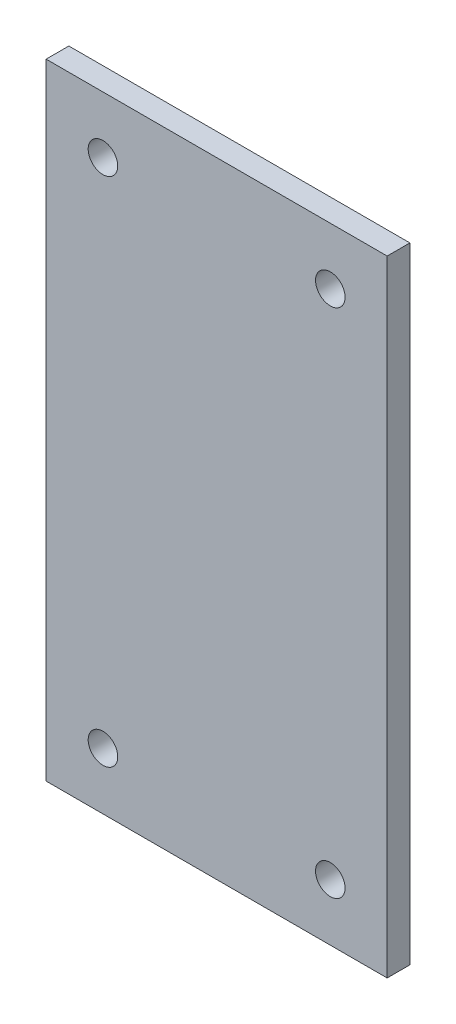
ISO-10303-21;
HEADER;
FILE_DESCRIPTION(('STEP AP214'),'2;1');
FILE_NAME('part.step','',(''),(''),'','','');
FILE_SCHEMA(('AUTOMOTIVE_DESIGN { 1 0 10303 214 1 1 1 1 }'));
ENDSEC;
DATA;
#1=APPLICATION_CONTEXT('core data for automotive mechanical design processes');
#2=APPLICATION_PROTOCOL_DEFINITION('international standard','automotive_design',2000,#1);
#3=PRODUCT_CONTEXT('',#1,'mechanical');
#4=PRODUCT('Part','Part','',(#3));
#5=PRODUCT_RELATED_PRODUCT_CATEGORY('part','',(#4));
#6=PRODUCT_DEFINITION_FORMATION('','',#4);
#7=PRODUCT_DEFINITION_CONTEXT('part definition',#1,'design');
#8=PRODUCT_DEFINITION('design','',#6,#7);
#9=PRODUCT_DEFINITION_SHAPE('','',#8);
#10=(LENGTH_UNIT() NAMED_UNIT(*) SI_UNIT(.MILLI.,.METRE.));
#11=(NAMED_UNIT(*) PLANE_ANGLE_UNIT() SI_UNIT($,.RADIAN.));
#12=(NAMED_UNIT(*) SI_UNIT($,.STERADIAN.) SOLID_ANGLE_UNIT());
#13=UNCERTAINTY_MEASURE_WITH_UNIT(LENGTH_MEASURE(1.E-05),#10,'distance_accuracy_value','');
#14=(GEOMETRIC_REPRESENTATION_CONTEXT(3) GLOBAL_UNCERTAINTY_ASSIGNED_CONTEXT((#13)) GLOBAL_UNIT_ASSIGNED_CONTEXT((#10,
#11,#12)) REPRESENTATION_CONTEXT('',''));
#15=CARTESIAN_POINT('',(0.,0.,0.));
#16=DIRECTION('',(0.,0.,1.));
#17=DIRECTION('',(1.,0.,0.));
#18=AXIS2_PLACEMENT_3D('',#15,#16,#17);
#19=CARTESIAN_POINT('',(0.,0.,20.));
#20=DIRECTION('',(0.,0.,1.));
#21=DIRECTION('',(1.,0.,0.));
#22=AXIS2_PLACEMENT_3D('',#19,#20,#21);
#23=PLANE('',#22);
#24=CARTESIAN_POINT('',(100.,-225.,20.));
#25=DIRECTION('',(0.,0.,1.));
#26=DIRECTION('',(1.,0.,0.));
#27=AXIS2_PLACEMENT_3D('',#24,#25,#26);
#28=CIRCLE('',#27,13.0000000000001);
#29=CARTESIAN_POINT('',(113.,-225.,20.));
#30=VERTEX_POINT('',#29);
#31=EDGE_CURVE('E123',#30,#30,#28,.T.);
#32=ORIENTED_EDGE('',*,*,#31,.F.);
#33=EDGE_LOOP('',(#32));
#34=FACE_BOUND('',#33,.T.);
#35=CARTESIAN_POINT('',(-100.,225.,20.));
#36=DIRECTION('',(0.,0.,1.));
#37=DIRECTION('',(1.,0.,0.));
#38=AXIS2_PLACEMENT_3D('',#35,#36,#37);
#39=CIRCLE('',#38,12.9999999999999);
#40=CARTESIAN_POINT('',(-87.0000000000001,225.,20.));
#41=VERTEX_POINT('',#40);
#42=EDGE_CURVE('E102',#41,#41,#39,.T.);
#43=ORIENTED_EDGE('',*,*,#42,.F.);
#44=EDGE_LOOP('',(#43));
#45=FACE_BOUND('',#44,.T.);
#46=DIRECTION('',(0.,1.,0.));
#47=VECTOR('',#46,1.);
#48=CARTESIAN_POINT('',(150.,-275.,20.));
#49=LINE('',#48,#47);
#50=CARTESIAN_POINT('',(150.,-275.,20.));
#51=VERTEX_POINT('',#50);
#52=CARTESIAN_POINT('',(150.,275.,20.));
#53=VERTEX_POINT('',#52);
#54=EDGE_CURVE('E87',#51,#53,#49,.T.);
#55=ORIENTED_EDGE('',*,*,#54,.T.);
#56=DIRECTION('',(-1.,0.,0.));
#57=VECTOR('',#56,1.);
#58=CARTESIAN_POINT('',(150.,275.,20.));
#59=LINE('',#58,#57);
#60=CARTESIAN_POINT('',(-150.,275.,20.));
#61=VERTEX_POINT('',#60);
#62=EDGE_CURVE('E82',#53,#61,#59,.T.);
#63=ORIENTED_EDGE('',*,*,#62,.T.);
#64=DIRECTION('',(0.,-1.,0.));
#65=VECTOR('',#64,1.);
#66=CARTESIAN_POINT('',(-150.,275.,20.));
#67=LINE('',#66,#65);
#68=CARTESIAN_POINT('',(-150.,-275.,20.));
#69=VERTEX_POINT('',#68);
#70=EDGE_CURVE('E85',#61,#69,#67,.T.);
#71=ORIENTED_EDGE('',*,*,#70,.T.);
#72=DIRECTION('',(1.,0.,0.));
#73=VECTOR('',#72,1.);
#74=CARTESIAN_POINT('',(-150.,-275.,20.));
#75=LINE('',#74,#73);
#76=EDGE_CURVE('E52',#69,#51,#75,.T.);
#77=ORIENTED_EDGE('',*,*,#76,.T.);
#78=EDGE_LOOP('',(#55,#63,#71,#77));
#79=FACE_BOUND('',#78,.T.);
#80=CARTESIAN_POINT('',(100.,225.,20.));
#81=DIRECTION('',(0.,0.,1.));
#82=DIRECTION('',(1.,0.,0.));
#83=AXIS2_PLACEMENT_3D('',#80,#81,#82);
#84=CIRCLE('',#83,12.9999999999999);
#85=CARTESIAN_POINT('',(113.,225.,20.));
#86=VERTEX_POINT('',#85);
#87=EDGE_CURVE('E117',#86,#86,#84,.T.);
#88=ORIENTED_EDGE('',*,*,#87,.F.);
#89=EDGE_LOOP('',(#88));
#90=FACE_BOUND('',#89,.T.);
#91=CARTESIAN_POINT('',(-100.,-225.,20.));
#92=DIRECTION('',(0.,0.,1.));
#93=DIRECTION('',(1.,0.,0.));
#94=AXIS2_PLACEMENT_3D('',#91,#92,#93);
#95=CIRCLE('',#94,13.0000000000001);
#96=CARTESIAN_POINT('',(-86.9999999999999,-225.,20.));
#97=VERTEX_POINT('',#96);
#98=EDGE_CURVE('E129',#97,#97,#95,.T.);
#99=ORIENTED_EDGE('',*,*,#98,.F.);
#100=EDGE_LOOP('',(#99));
#101=FACE_BOUND('',#100,.T.);
#102=ADVANCED_FACE('F35',(#34,#45,#79,#90,#101),#23,.T.);
#103=CARTESIAN_POINT('',(0.,0.,0.));
#104=DIRECTION('',(0.,0.,1.));
#105=DIRECTION('',(1.,0.,0.));
#106=AXIS2_PLACEMENT_3D('',#103,#104,#105);
#107=PLANE('',#106);
#108=DIRECTION('',(0.,1.,0.));
#109=VECTOR('',#108,1.);
#110=CARTESIAN_POINT('',(150.,-275.,0.));
#111=LINE('',#110,#109);
#112=CARTESIAN_POINT('',(150.,-275.,0.));
#113=VERTEX_POINT('',#112);
#114=CARTESIAN_POINT('',(150.,275.,0.));
#115=VERTEX_POINT('',#114);
#116=EDGE_CURVE('E99',#113,#115,#111,.T.);
#117=ORIENTED_EDGE('',*,*,#116,.F.);
#118=DIRECTION('',(1.,0.,0.));
#119=VECTOR('',#118,1.);
#120=CARTESIAN_POINT('',(-150.,-275.,0.));
#121=LINE('',#120,#119);
#122=CARTESIAN_POINT('',(-150.,-275.,0.));
#123=VERTEX_POINT('',#122);
#124=EDGE_CURVE('E75',#123,#113,#121,.T.);
#125=ORIENTED_EDGE('',*,*,#124,.F.);
#126=DIRECTION('',(0.,-1.,0.));
#127=VECTOR('',#126,1.);
#128=CARTESIAN_POINT('',(-150.,275.,0.));
#129=LINE('',#128,#127);
#130=CARTESIAN_POINT('',(-150.,275.,0.));
#131=VERTEX_POINT('',#130);
#132=EDGE_CURVE('E69',#131,#123,#129,.T.);
#133=ORIENTED_EDGE('',*,*,#132,.F.);
#134=DIRECTION('',(-1.,0.,0.));
#135=VECTOR('',#134,1.);
#136=CARTESIAN_POINT('',(150.,275.,0.));
#137=LINE('',#136,#135);
#138=EDGE_CURVE('E91',#115,#131,#137,.T.);
#139=ORIENTED_EDGE('',*,*,#138,.F.);
#140=EDGE_LOOP('',(#117,#125,#133,#139));
#141=FACE_BOUND('',#140,.T.);
#142=CARTESIAN_POINT('',(-100.,225.,0.));
#143=DIRECTION('',(0.,0.,1.));
#144=DIRECTION('',(1.,0.,0.));
#145=AXIS2_PLACEMENT_3D('',#142,#143,#144);
#146=CIRCLE('',#145,12.9999999999999);
#147=CARTESIAN_POINT('',(-87.0000000000001,225.,0.));
#148=VERTEX_POINT('',#147);
#149=EDGE_CURVE('E114',#148,#148,#146,.T.);
#150=ORIENTED_EDGE('',*,*,#149,.T.);
#151=EDGE_LOOP('',(#150));
#152=FACE_BOUND('',#151,.T.);
#153=CARTESIAN_POINT('',(100.,225.,0.));
#154=DIRECTION('',(0.,0.,1.));
#155=DIRECTION('',(1.,0.,0.));
#156=AXIS2_PLACEMENT_3D('',#153,#154,#155);
#157=CIRCLE('',#156,12.9999999999999);
#158=CARTESIAN_POINT('',(113.,225.,0.));
#159=VERTEX_POINT('',#158);
#160=EDGE_CURVE('E120',#159,#159,#157,.T.);
#161=ORIENTED_EDGE('',*,*,#160,.T.);
#162=EDGE_LOOP('',(#161));
#163=FACE_BOUND('',#162,.T.);
#164=CARTESIAN_POINT('',(100.,-225.,0.));
#165=DIRECTION('',(0.,0.,1.));
#166=DIRECTION('',(1.,0.,0.));
#167=AXIS2_PLACEMENT_3D('',#164,#165,#166);
#168=CIRCLE('',#167,13.0000000000001);
#169=CARTESIAN_POINT('',(113.,-225.,0.));
#170=VERTEX_POINT('',#169);
#171=EDGE_CURVE('E126',#170,#170,#168,.T.);
#172=ORIENTED_EDGE('',*,*,#171,.T.);
#173=EDGE_LOOP('',(#172));
#174=FACE_BOUND('',#173,.T.);
#175=CARTESIAN_POINT('',(-100.,-225.,0.));
#176=DIRECTION('',(0.,0.,1.));
#177=DIRECTION('',(1.,0.,0.));
#178=AXIS2_PLACEMENT_3D('',#175,#176,#177);
#179=CIRCLE('',#178,13.0000000000001);
#180=CARTESIAN_POINT('',(-86.9999999999999,-225.,0.));
#181=VERTEX_POINT('',#180);
#182=EDGE_CURVE('E132',#181,#181,#179,.T.);
#183=ORIENTED_EDGE('',*,*,#182,.T.);
#184=EDGE_LOOP('',(#183));
#185=FACE_BOUND('',#184,.T.);
#186=ADVANCED_FACE('F110',(#141,#152,#163,#174,#185),#107,.F.);
#187=CARTESIAN_POINT('',(150.,-275.,20.));
#188=DIRECTION('',(-1.,0.,0.));
#189=DIRECTION('',(0.,0.,1.));
#190=AXIS2_PLACEMENT_3D('',#187,#188,#189);
#191=PLANE('',#190);
#192=ORIENTED_EDGE('',*,*,#116,.T.);
#193=DIRECTION('',(0.,0.,-1.));
#194=VECTOR('',#193,1.);
#195=CARTESIAN_POINT('',(150.,275.,20.));
#196=LINE('',#195,#194);
#197=EDGE_CURVE('E11',#53,#115,#196,.T.);
#198=ORIENTED_EDGE('',*,*,#197,.F.);
#199=ORIENTED_EDGE('',*,*,#54,.F.);
#200=DIRECTION('',(0.,0.,-1.));
#201=VECTOR('',#200,1.);
#202=CARTESIAN_POINT('',(150.,-275.,20.));
#203=LINE('',#202,#201);
#204=EDGE_CURVE('E95',#51,#113,#203,.T.);
#205=ORIENTED_EDGE('',*,*,#204,.T.);
#206=EDGE_LOOP('',(#192,#198,#199,#205));
#207=FACE_BOUND('',#206,.T.);
#208=ADVANCED_FACE('F37',(#207),#191,.F.);
#209=CARTESIAN_POINT('',(150.,275.,20.));
#210=DIRECTION('',(0.,-1.,0.));
#211=DIRECTION('',(0.,0.,-1.));
#212=AXIS2_PLACEMENT_3D('',#209,#210,#211);
#213=PLANE('',#212);
#214=ORIENTED_EDGE('',*,*,#138,.T.);
#215=DIRECTION('',(0.,0.,-1.));
#216=VECTOR('',#215,1.);
#217=CARTESIAN_POINT('',(-150.,275.,20.));
#218=LINE('',#217,#216);
#219=EDGE_CURVE('E44',#61,#131,#218,.T.);
#220=ORIENTED_EDGE('',*,*,#219,.F.);
#221=ORIENTED_EDGE('',*,*,#62,.F.);
#222=ORIENTED_EDGE('',*,*,#197,.T.);
#223=EDGE_LOOP('',(#214,#220,#221,#222));
#224=FACE_BOUND('',#223,.T.);
#225=ADVANCED_FACE('F90',(#224),#213,.F.);
#226=CARTESIAN_POINT('',(-150.,275.,20.));
#227=DIRECTION('',(1.,0.,0.));
#228=DIRECTION('',(0.,0.,-1.));
#229=AXIS2_PLACEMENT_3D('',#226,#227,#228);
#230=PLANE('',#229);
#231=ORIENTED_EDGE('',*,*,#132,.T.);
#232=DIRECTION('',(0.,0.,-1.));
#233=VECTOR('',#232,1.);
#234=CARTESIAN_POINT('',(-150.,-275.,20.));
#235=LINE('',#234,#233);
#236=EDGE_CURVE('E92',#69,#123,#235,.T.);
#237=ORIENTED_EDGE('',*,*,#236,.F.);
#238=ORIENTED_EDGE('',*,*,#70,.F.);
#239=ORIENTED_EDGE('',*,*,#219,.T.);
#240=EDGE_LOOP('',(#231,#237,#238,#239));
#241=FACE_BOUND('',#240,.T.);
#242=ADVANCED_FACE('F93',(#241),#230,.F.);
#243=CARTESIAN_POINT('',(-150.,-275.,20.));
#244=DIRECTION('',(0.,1.,0.));
#245=DIRECTION('',(0.,0.,1.));
#246=AXIS2_PLACEMENT_3D('',#243,#244,#245);
#247=PLANE('',#246);
#248=ORIENTED_EDGE('',*,*,#124,.T.);
#249=ORIENTED_EDGE('',*,*,#204,.F.);
#250=ORIENTED_EDGE('',*,*,#76,.F.);
#251=ORIENTED_EDGE('',*,*,#236,.T.);
#252=EDGE_LOOP('',(#248,#249,#250,#251));
#253=FACE_BOUND('',#252,.T.);
#254=ADVANCED_FACE('F107',(#253),#247,.F.);
#255=CARTESIAN_POINT('',(-100.,225.,20.));
#256=DIRECTION('',(0.,0.,-1.));
#257=DIRECTION('',(-1.,0.,0.));
#258=AXIS2_PLACEMENT_3D('',#255,#256,#257);
#259=CYLINDRICAL_SURFACE('',#258,12.9999999999999);
#260=ORIENTED_EDGE('',*,*,#42,.T.);
#261=EDGE_LOOP('',(#260));
#262=FACE_BOUND('',#261,.T.);
#263=ORIENTED_EDGE('',*,*,#149,.F.);
#264=EDGE_LOOP('',(#263));
#265=FACE_BOUND('',#264,.T.);
#266=ADVANCED_FACE('F151',(#262,#265),#259,.F.);
#267=CARTESIAN_POINT('',(100.,225.,20.));
#268=DIRECTION('',(0.,0.,-1.));
#269=DIRECTION('',(-1.,0.,0.));
#270=AXIS2_PLACEMENT_3D('',#267,#268,#269);
#271=CYLINDRICAL_SURFACE('',#270,12.9999999999999);
#272=ORIENTED_EDGE('',*,*,#87,.T.);
#273=EDGE_LOOP('',(#272));
#274=FACE_BOUND('',#273,.T.);
#275=ORIENTED_EDGE('',*,*,#160,.F.);
#276=EDGE_LOOP('',(#275));
#277=FACE_BOUND('',#276,.T.);
#278=ADVANCED_FACE('F197',(#274,#277),#271,.F.);
#279=CARTESIAN_POINT('',(100.,-225.,20.));
#280=DIRECTION('',(0.,0.,-1.));
#281=DIRECTION('',(-1.,0.,0.));
#282=AXIS2_PLACEMENT_3D('',#279,#280,#281);
#283=CYLINDRICAL_SURFACE('',#282,13.0000000000001);
#284=ORIENTED_EDGE('',*,*,#31,.T.);
#285=EDGE_LOOP('',(#284));
#286=FACE_BOUND('',#285,.T.);
#287=ORIENTED_EDGE('',*,*,#171,.F.);
#288=EDGE_LOOP('',(#287));
#289=FACE_BOUND('',#288,.T.);
#290=ADVANCED_FACE('F205',(#286,#289),#283,.F.);
#291=CARTESIAN_POINT('',(-100.,-225.,20.));
#292=DIRECTION('',(0.,0.,-1.));
#293=DIRECTION('',(-1.,0.,0.));
#294=AXIS2_PLACEMENT_3D('',#291,#292,#293);
#295=CYLINDRICAL_SURFACE('',#294,13.0000000000001);
#296=ORIENTED_EDGE('',*,*,#98,.T.);
#297=EDGE_LOOP('',(#296));
#298=FACE_BOUND('',#297,.T.);
#299=ORIENTED_EDGE('',*,*,#182,.F.);
#300=EDGE_LOOP('',(#299));
#301=FACE_BOUND('',#300,.T.);
#302=ADVANCED_FACE('F138',(#298,#301),#295,.F.);
#303=CLOSED_SHELL('',(#102,#186,#208,#225,#242,#254,#266,#278,#290,#302));
#304=MANIFOLD_SOLID_BREP('B2',#303);
#305=ADVANCED_BREP_SHAPE_REPRESENTATION('',(#18,#304),#14);
#306=SHAPE_DEFINITION_REPRESENTATION(#9,#305);
ENDSEC;
END-ISO-10303-21;
